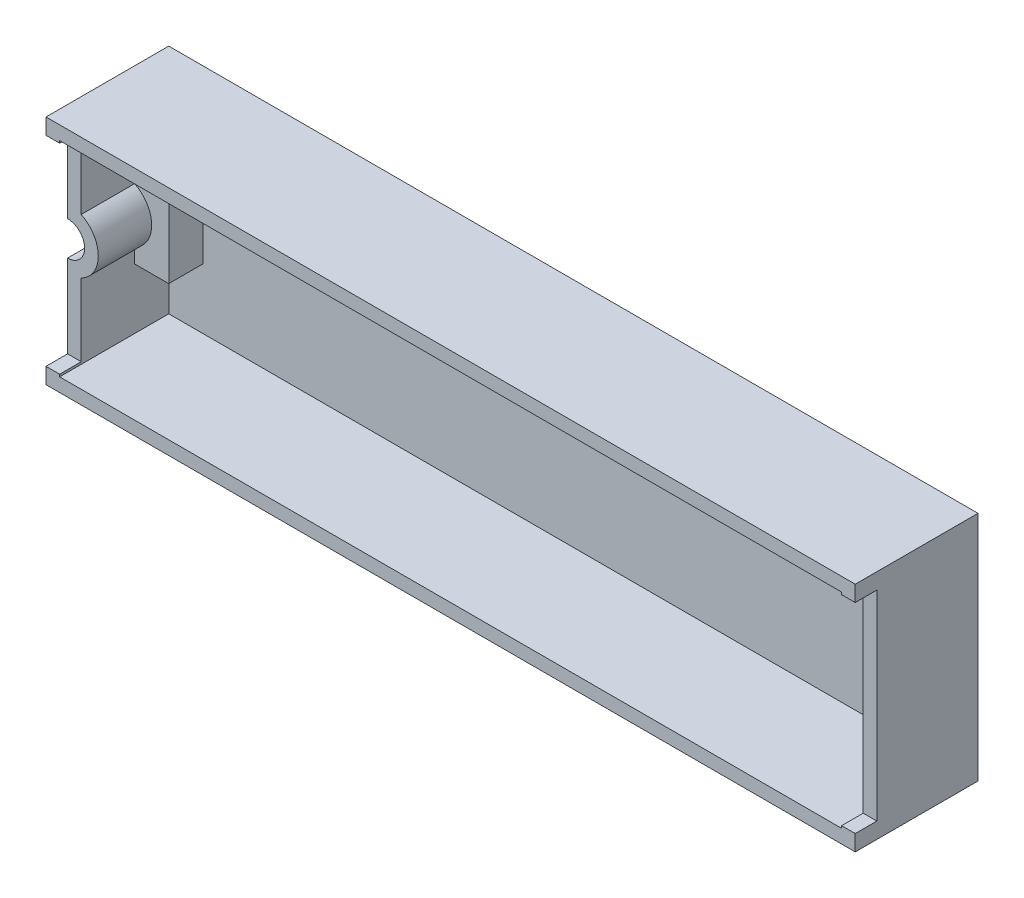
ISO-10303-21;
HEADER;
FILE_DESCRIPTION(('STEP AP214'),'2;1');
FILE_NAME('part.step','',(''),(''),'','','');
FILE_SCHEMA(('AUTOMOTIVE_DESIGN { 1 0 10303 214 1 1 1 1 }'));
ENDSEC;
DATA;
#1=APPLICATION_CONTEXT('core data for automotive mechanical design processes');
#2=APPLICATION_PROTOCOL_DEFINITION('international standard','automotive_design',2000,#1);
#3=PRODUCT_CONTEXT('',#1,'mechanical');
#4=PRODUCT('Part','Part','',(#3));
#5=PRODUCT_RELATED_PRODUCT_CATEGORY('part','',(#4));
#6=PRODUCT_DEFINITION_FORMATION('','',#4);
#7=PRODUCT_DEFINITION_CONTEXT('part definition',#1,'design');
#8=PRODUCT_DEFINITION('design','',#6,#7);
#9=PRODUCT_DEFINITION_SHAPE('','',#8);
#10=(LENGTH_UNIT() NAMED_UNIT(*) SI_UNIT(.MILLI.,.METRE.));
#11=(NAMED_UNIT(*) PLANE_ANGLE_UNIT() SI_UNIT($,.RADIAN.));
#12=(NAMED_UNIT(*) SI_UNIT($,.STERADIAN.) SOLID_ANGLE_UNIT());
#13=UNCERTAINTY_MEASURE_WITH_UNIT(LENGTH_MEASURE(1.E-05),#10,'distance_accuracy_value','');
#14=(GEOMETRIC_REPRESENTATION_CONTEXT(3) GLOBAL_UNCERTAINTY_ASSIGNED_CONTEXT((#13)) GLOBAL_UNIT_ASSIGNED_CONTEXT((#10,
#11,#12)) REPRESENTATION_CONTEXT('',''));
#15=CARTESIAN_POINT('',(0.,0.,0.));
#16=DIRECTION('',(0.,0.,1.));
#17=DIRECTION('',(1.,0.,0.));
#18=AXIS2_PLACEMENT_3D('',#15,#16,#17);
#19=CARTESIAN_POINT('',(-15.7,-1.25,0.));
#20=DIRECTION('',(1.,0.,0.));
#21=DIRECTION('',(0.,0.,-1.));
#22=AXIS2_PLACEMENT_3D('',#19,#20,#21);
#23=PLANE('',#22);
#24=DIRECTION('',(0.,1.,0.));
#25=VECTOR('',#24,1.);
#26=CARTESIAN_POINT('',(-15.7,0.,2.1));
#27=LINE('',#26,#25);
#28=CARTESIAN_POINT('',(-15.7,-1.85,2.1));
#29=VERTEX_POINT('',#28);
#30=CARTESIAN_POINT('',(-15.7,1.85,2.1));
#31=VERTEX_POINT('',#30);
#32=EDGE_CURVE('E291',#29,#31,#27,.T.);
#33=ORIENTED_EDGE('',*,*,#32,.F.);
#34=DIRECTION('',(0.,0.,-1.));
#35=VECTOR('',#34,1.);
#36=CARTESIAN_POINT('',(-15.7,-1.85,0.));
#37=LINE('',#36,#35);
#38=CARTESIAN_POINT('',(-15.7,-1.85,0.6));
#39=VERTEX_POINT('',#38);
#40=EDGE_CURVE('E296',#39,#29,#37,.F.);
#41=ORIENTED_EDGE('',*,*,#40,.F.);
#42=DIRECTION('',(0.,1.,0.));
#43=VECTOR('',#42,1.);
#44=CARTESIAN_POINT('',(-15.7,0.,0.6));
#45=LINE('',#44,#43);
#46=CARTESIAN_POINT('',(-15.7,1.85,0.6));
#47=VERTEX_POINT('',#46);
#48=EDGE_CURVE('E286',#47,#39,#45,.F.);
#49=ORIENTED_EDGE('',*,*,#48,.F.);
#50=DIRECTION('',(0.,0.,1.));
#51=VECTOR('',#50,1.);
#52=CARTESIAN_POINT('',(-15.7,1.85,0.));
#53=LINE('',#52,#51);
#54=EDGE_CURVE('E292',#31,#47,#53,.F.);
#55=ORIENTED_EDGE('',*,*,#54,.F.);
#56=EDGE_LOOP('',(#33,#41,#49,#55));
#57=FACE_BOUND('',#56,.T.);
#58=ADVANCED_FACE('F16',(#57),#23,.T.);
#59=CARTESIAN_POINT('',(-16.3,1.85,0.));
#60=DIRECTION('',(0.,1.,0.));
#61=DIRECTION('',(0.,0.,1.));
#62=AXIS2_PLACEMENT_3D('',#59,#60,#61);
#63=PLANE('',#62);
#64=DIRECTION('',(1.,0.,0.));
#65=VECTOR('',#64,1.);
#66=CARTESIAN_POINT('',(-17.05,1.85,2.1));
#67=LINE('',#66,#65);
#68=CARTESIAN_POINT('',(-17.2,1.85,2.1));
#69=VERTEX_POINT('',#68);
#70=EDGE_CURVE('E214',#31,#69,#67,.F.);
#71=ORIENTED_EDGE('',*,*,#70,.F.);
#72=ORIENTED_EDGE('',*,*,#54,.T.);
#73=DIRECTION('',(1.,0.,0.));
#74=VECTOR('',#73,1.);
#75=CARTESIAN_POINT('',(-0.042575970452277,1.85,0.6));
#76=LINE('',#75,#74);
#77=CARTESIAN_POINT('',(-17.2,1.85,0.6));
#78=VERTEX_POINT('',#77);
#79=EDGE_CURVE('E307',#78,#47,#76,.T.);
#80=ORIENTED_EDGE('',*,*,#79,.F.);
#81=DIRECTION('',(0.,0.,1.));
#82=VECTOR('',#81,1.);
#83=CARTESIAN_POINT('',(-17.2,1.85,0.));
#84=LINE('',#83,#82);
#85=EDGE_CURVE('E218',#78,#69,#84,.T.);
#86=ORIENTED_EDGE('',*,*,#85,.T.);
#87=EDGE_LOOP('',(#71,#72,#80,#86));
#88=FACE_BOUND('',#87,.T.);
#89=ADVANCED_FACE('F643',(#88),#63,.T.);
#90=CARTESIAN_POINT('',(-17.05,0.,2.1));
#91=DIRECTION('',(0.,0.,1.));
#92=DIRECTION('',(1.,0.,0.));
#93=AXIS2_PLACEMENT_3D('',#90,#91,#92);
#94=PLANE('',#93);
#95=ORIENTED_EDGE('',*,*,#70,.T.);
#96=DIRECTION('',(0.,1.,0.));
#97=VECTOR('',#96,1.);
#98=CARTESIAN_POINT('',(-17.2,5.1,2.1));
#99=LINE('',#98,#97);
#100=CARTESIAN_POINT('',(-17.2,1.20933866224478,2.1));
#101=VERTEX_POINT('',#100);
#102=EDGE_CURVE('E210',#69,#101,#99,.F.);
#103=ORIENTED_EDGE('',*,*,#102,.T.);
#104=CARTESIAN_POINT('',(-17.8,0.,2.1));
#105=DIRECTION('',(0.,0.,1.));
#106=DIRECTION('',(1.,0.,0.));
#107=AXIS2_PLACEMENT_3D('',#104,#105,#106);
#108=CIRCLE('',#107,1.35);
#109=CARTESIAN_POINT('',(-17.2,-1.20933866224478,2.1));
#110=VERTEX_POINT('',#109);
#111=EDGE_CURVE('E19',#110,#101,#108,.T.);
#112=ORIENTED_EDGE('',*,*,#111,.F.);
#113=DIRECTION('',(0.,1.,0.));
#114=VECTOR('',#113,1.);
#115=CARTESIAN_POINT('',(-17.2,0.,2.1));
#116=LINE('',#115,#114);
#117=CARTESIAN_POINT('',(-17.2,-1.85,2.1));
#118=VERTEX_POINT('',#117);
#119=EDGE_CURVE('E197',#110,#118,#116,.F.);
#120=ORIENTED_EDGE('',*,*,#119,.T.);
#121=DIRECTION('',(1.,0.,0.));
#122=VECTOR('',#121,1.);
#123=CARTESIAN_POINT('',(-17.8,-1.85,2.1));
#124=LINE('',#123,#122);
#125=EDGE_CURVE('E310',#29,#118,#124,.F.);
#126=ORIENTED_EDGE('',*,*,#125,.F.);
#127=ORIENTED_EDGE('',*,*,#32,.T.);
#128=EDGE_LOOP('',(#95,#103,#112,#120,#126,#127));
#129=FACE_BOUND('',#128,.T.);
#130=ADVANCED_FACE('F212',(#129),#94,.T.);
#131=CARTESIAN_POINT('',(-17.8,-1.85,0.));
#132=DIRECTION('',(0.,-1.,0.));
#133=DIRECTION('',(0.,0.,-1.));
#134=AXIS2_PLACEMENT_3D('',#131,#132,#133);
#135=PLANE('',#134);
#136=ORIENTED_EDGE('',*,*,#125,.T.);
#137=DIRECTION('',(0.,0.,1.));
#138=VECTOR('',#137,1.);
#139=CARTESIAN_POINT('',(-17.2,-1.85,0.));
#140=LINE('',#139,#138);
#141=CARTESIAN_POINT('',(-17.2,-1.85,0.6));
#142=VERTEX_POINT('',#141);
#143=EDGE_CURVE('E225',#118,#142,#140,.F.);
#144=ORIENTED_EDGE('',*,*,#143,.T.);
#145=DIRECTION('',(1.,0.,0.));
#146=VECTOR('',#145,1.);
#147=CARTESIAN_POINT('',(-0.042575970452277,-1.85,0.6));
#148=LINE('',#147,#146);
#149=EDGE_CURVE('E284',#39,#142,#148,.F.);
#150=ORIENTED_EDGE('',*,*,#149,.F.);
#151=ORIENTED_EDGE('',*,*,#40,.T.);
#152=EDGE_LOOP('',(#136,#144,#150,#151));
#153=FACE_BOUND('',#152,.T.);
#154=ADVANCED_FACE('F637',(#153),#135,.T.);
#155=CARTESIAN_POINT('',(-0.042575970452277,0.,0.6));
#156=DIRECTION('',(0.,0.,1.));
#157=DIRECTION('',(1.,0.,0.));
#158=AXIS2_PLACEMENT_3D('',#155,#156,#157);
#159=PLANE('',#158);
#160=DIRECTION('',(1.,0.,0.));
#161=VECTOR('',#160,1.);
#162=CARTESIAN_POINT('',(17.8,4.5,0.6));
#163=LINE('',#162,#161);
#164=CARTESIAN_POINT('',(17.2,4.5,0.6));
#165=VERTEX_POINT('',#164);
#166=CARTESIAN_POINT('',(-17.2,4.5,0.6));
#167=VERTEX_POINT('',#166);
#168=EDGE_CURVE('E232',#165,#167,#163,.F.);
#169=ORIENTED_EDGE('',*,*,#168,.T.);
#170=DIRECTION('',(0.,1.,0.));
#171=VECTOR('',#170,1.);
#172=CARTESIAN_POINT('',(-17.2,5.1,0.6));
#173=LINE('',#172,#171);
#174=EDGE_CURVE('E300',#167,#78,#173,.F.);
#175=ORIENTED_EDGE('',*,*,#174,.T.);
#176=ORIENTED_EDGE('',*,*,#79,.T.);
#177=ORIENTED_EDGE('',*,*,#48,.T.);
#178=ORIENTED_EDGE('',*,*,#149,.T.);
#179=DIRECTION('',(0.,1.,0.));
#180=VECTOR('',#179,1.);
#181=CARTESIAN_POINT('',(-17.2,-0.75,0.6));
#182=LINE('',#181,#180);
#183=CARTESIAN_POINT('',(-17.2,-4.5,0.6));
#184=VERTEX_POINT('',#183);
#185=EDGE_CURVE('E382',#142,#184,#182,.F.);
#186=ORIENTED_EDGE('',*,*,#185,.T.);
#187=DIRECTION('',(1.,0.,0.));
#188=VECTOR('',#187,1.);
#189=CARTESIAN_POINT('',(-17.8,-4.5,0.6));
#190=LINE('',#189,#188);
#191=CARTESIAN_POINT('',(17.2,-4.5,0.6));
#192=VERTEX_POINT('',#191);
#193=EDGE_CURVE('E285',#184,#192,#190,.T.);
#194=ORIENTED_EDGE('',*,*,#193,.T.);
#195=DIRECTION('',(0.,1.,0.));
#196=VECTOR('',#195,1.);
#197=CARTESIAN_POINT('',(17.2,-5.1,0.6));
#198=LINE('',#197,#196);
#199=EDGE_CURVE('E345',#192,#165,#198,.T.);
#200=ORIENTED_EDGE('',*,*,#199,.T.);
#201=EDGE_LOOP('',(#169,#175,#176,#177,#178,#186,#194,#200));
#202=FACE_BOUND('',#201,.T.);
#203=ADVANCED_FACE('F633',(#202),#159,.T.);
#204=CARTESIAN_POINT('',(-17.8,-4.5,0.));
#205=DIRECTION('',(0.,-1.,0.));
#206=DIRECTION('',(0.,0.,-1.));
#207=AXIS2_PLACEMENT_3D('',#204,#205,#206);
#208=PLANE('',#207);
#209=DIRECTION('',(0.,0.,1.));
#210=VECTOR('',#209,1.);
#211=CARTESIAN_POINT('',(-17.2,-4.5,0.));
#212=LINE('',#211,#210);
#213=CARTESIAN_POINT('',(-17.2,-4.5,5.4));
#214=VERTEX_POINT('',#213);
#215=EDGE_CURVE('E379',#184,#214,#212,.T.);
#216=ORIENTED_EDGE('',*,*,#215,.T.);
#217=DIRECTION('',(1.,0.,0.));
#218=VECTOR('',#217,1.);
#219=CARTESIAN_POINT('',(-0.042575970452277,-4.5,5.4));
#220=LINE('',#219,#218);
#221=CARTESIAN_POINT('',(17.2,-4.5,5.4));
#222=VERTEX_POINT('',#221);
#223=EDGE_CURVE('E245',#222,#214,#220,.F.);
#224=ORIENTED_EDGE('',*,*,#223,.F.);
#225=DIRECTION('',(0.,0.,-1.));
#226=VECTOR('',#225,1.);
#227=CARTESIAN_POINT('',(17.2,-4.5,0.));
#228=LINE('',#227,#226);
#229=EDGE_CURVE('E347',#222,#192,#228,.T.);
#230=ORIENTED_EDGE('',*,*,#229,.T.);
#231=ORIENTED_EDGE('',*,*,#193,.F.);
#232=EDGE_LOOP('',(#216,#224,#230,#231));
#233=FACE_BOUND('',#232,.T.);
#234=ADVANCED_FACE('F629',(#233),#208,.F.);
#235=CARTESIAN_POINT('',(17.2,-5.1,0.));
#236=DIRECTION('',(1.,0.,0.));
#237=DIRECTION('',(0.,0.,-1.));
#238=AXIS2_PLACEMENT_3D('',#235,#236,#237);
#239=PLANE('',#238);
#240=DIRECTION('',(0.,1.,0.));
#241=VECTOR('',#240,1.);
#242=CARTESIAN_POINT('',(17.2,-4.4,4.45));
#243=LINE('',#242,#241);
#244=CARTESIAN_POINT('',(17.2,-4.4,4.45));
#245=VERTEX_POINT('',#244);
#246=CARTESIAN_POINT('',(17.2,4.4,4.45));
#247=VERTEX_POINT('',#246);
#248=EDGE_CURVE('E362',#245,#247,#243,.T.);
#249=ORIENTED_EDGE('',*,*,#248,.T.);
#250=DIRECTION('',(0.,0.,1.));
#251=VECTOR('',#250,1.);
#252=CARTESIAN_POINT('',(17.2,4.4,4.45));
#253=LINE('',#252,#251);
#254=CARTESIAN_POINT('',(17.2,4.4,5.4));
#255=VERTEX_POINT('',#254);
#256=EDGE_CURVE('E353',#247,#255,#253,.T.);
#257=ORIENTED_EDGE('',*,*,#256,.T.);
#258=DIRECTION('',(0.,1.,0.));
#259=VECTOR('',#258,1.);
#260=CARTESIAN_POINT('',(17.2,-5.1,5.4));
#261=LINE('',#260,#259);
#262=CARTESIAN_POINT('',(17.2,4.5,5.4));
#263=VERTEX_POINT('',#262);
#264=EDGE_CURVE('E342',#263,#255,#261,.F.);
#265=ORIENTED_EDGE('',*,*,#264,.F.);
#266=DIRECTION('',(0.,0.,1.));
#267=VECTOR('',#266,1.);
#268=CARTESIAN_POINT('',(17.2,4.5,0.));
#269=LINE('',#268,#267);
#270=EDGE_CURVE('E318',#263,#165,#269,.F.);
#271=ORIENTED_EDGE('',*,*,#270,.T.);
#272=ORIENTED_EDGE('',*,*,#199,.F.);
#273=ORIENTED_EDGE('',*,*,#229,.F.);
#274=DIRECTION('',(0.,1.,0.));
#275=VECTOR('',#274,1.);
#276=CARTESIAN_POINT('',(17.2,0.,5.4));
#277=LINE('',#276,#275);
#278=CARTESIAN_POINT('',(17.2,-4.4,5.4));
#279=VERTEX_POINT('',#278);
#280=EDGE_CURVE('E238',#279,#222,#277,.F.);
#281=ORIENTED_EDGE('',*,*,#280,.F.);
#282=DIRECTION('',(0.,0.,-1.));
#283=VECTOR('',#282,1.);
#284=CARTESIAN_POINT('',(17.2,-4.4,5.4));
#285=LINE('',#284,#283);
#286=EDGE_CURVE('E357',#279,#245,#285,.T.);
#287=ORIENTED_EDGE('',*,*,#286,.T.);
#288=EDGE_LOOP('',(#249,#257,#265,#271,#272,#273,#281,#287));
#289=FACE_BOUND('',#288,.T.);
#290=ADVANCED_FACE('F625',(#289),#239,.F.);
#291=CARTESIAN_POINT('',(17.8,4.5,0.));
#292=DIRECTION('',(0.,1.,0.));
#293=DIRECTION('',(0.,0.,1.));
#294=AXIS2_PLACEMENT_3D('',#291,#292,#293);
#295=PLANE('',#294);
#296=ORIENTED_EDGE('',*,*,#270,.F.);
#297=DIRECTION('',(1.,0.,0.));
#298=VECTOR('',#297,1.);
#299=CARTESIAN_POINT('',(-0.042575970452277,4.5,5.4));
#300=LINE('',#299,#298);
#301=CARTESIAN_POINT('',(-17.2,4.5,5.4));
#302=VERTEX_POINT('',#301);
#303=EDGE_CURVE('E324',#302,#263,#300,.T.);
#304=ORIENTED_EDGE('',*,*,#303,.F.);
#305=DIRECTION('',(0.,0.,1.));
#306=VECTOR('',#305,1.);
#307=CARTESIAN_POINT('',(-17.2,4.5,0.));
#308=LINE('',#307,#306);
#309=EDGE_CURVE('E231',#302,#167,#308,.F.);
#310=ORIENTED_EDGE('',*,*,#309,.T.);
#311=ORIENTED_EDGE('',*,*,#168,.F.);
#312=EDGE_LOOP('',(#296,#304,#310,#311));
#313=FACE_BOUND('',#312,.T.);
#314=ADVANCED_FACE('F622',(#313),#295,.F.);
#315=CARTESIAN_POINT('',(-17.2,5.1,0.));
#316=DIRECTION('',(-1.,0.,0.));
#317=DIRECTION('',(0.,0.,1.));
#318=AXIS2_PLACEMENT_3D('',#315,#316,#317);
#319=PLANE('',#318);
#320=DIRECTION('',(0.,0.,1.));
#321=VECTOR('',#320,1.);
#322=CARTESIAN_POINT('',(-17.2,1.20933866224478,0.));
#323=LINE('',#322,#321);
#324=CARTESIAN_POINT('',(-17.2,1.20933866224478,4.45));
#325=VERTEX_POINT('',#324);
#326=EDGE_CURVE('E206',#101,#325,#323,.T.);
#327=ORIENTED_EDGE('',*,*,#326,.F.);
#328=ORIENTED_EDGE('',*,*,#102,.F.);
#329=ORIENTED_EDGE('',*,*,#85,.F.);
#330=ORIENTED_EDGE('',*,*,#174,.F.);
#331=ORIENTED_EDGE('',*,*,#309,.F.);
#332=DIRECTION('',(0.,1.,0.));
#333=VECTOR('',#332,1.);
#334=CARTESIAN_POINT('',(-17.2,0.,5.4));
#335=LINE('',#334,#333);
#336=CARTESIAN_POINT('',(-17.2,4.4,5.4));
#337=VERTEX_POINT('',#336);
#338=EDGE_CURVE('E321',#337,#302,#335,.T.);
#339=ORIENTED_EDGE('',*,*,#338,.F.);
#340=DIRECTION('',(0.,0.,1.));
#341=VECTOR('',#340,1.);
#342=CARTESIAN_POINT('',(-17.2,4.4,0.));
#343=LINE('',#342,#341);
#344=CARTESIAN_POINT('',(-17.2,4.4,4.45));
#345=VERTEX_POINT('',#344);
#346=EDGE_CURVE('E229',#345,#337,#343,.T.);
#347=ORIENTED_EDGE('',*,*,#346,.F.);
#348=DIRECTION('',(0.,1.,0.));
#349=VECTOR('',#348,1.);
#350=CARTESIAN_POINT('',(-17.2,-4.4,4.45));
#351=LINE('',#350,#349);
#352=EDGE_CURVE('E223',#345,#325,#351,.F.);
#353=ORIENTED_EDGE('',*,*,#352,.T.);
#354=EDGE_LOOP('',(#327,#328,#329,#330,#331,#339,#347,#353));
#355=FACE_BOUND('',#354,.T.);
#356=ADVANCED_FACE('F221',(#355),#319,.F.);
#357=CARTESIAN_POINT('',(-17.8,0.,0.));
#358=DIRECTION('',(0.,0.,1.));
#359=DIRECTION('',(1.,0.,0.));
#360=AXIS2_PLACEMENT_3D('',#357,#358,#359);
#361=CYLINDRICAL_SURFACE('',#360,1.35);
#362=ORIENTED_EDGE('',*,*,#111,.T.);
#363=ORIENTED_EDGE('',*,*,#326,.T.);
#364=CARTESIAN_POINT('',(-17.8,0.,4.45));
#365=DIRECTION('',(0.,0.,1.));
#366=DIRECTION('',(1.,0.,0.));
#367=AXIS2_PLACEMENT_3D('',#364,#365,#366);
#368=CIRCLE('',#367,1.35);
#369=CARTESIAN_POINT('',(-17.2,-1.20933866224478,4.45));
#370=VERTEX_POINT('',#369);
#371=EDGE_CURVE('E412',#325,#370,#368,.F.);
#372=ORIENTED_EDGE('',*,*,#371,.T.);
#373=DIRECTION('',(0.,0.,1.));
#374=VECTOR('',#373,1.);
#375=CARTESIAN_POINT('',(-17.2,-1.20933866224478,0.));
#376=LINE('',#375,#374);
#377=EDGE_CURVE('E208',#370,#110,#376,.F.);
#378=ORIENTED_EDGE('',*,*,#377,.T.);
#379=EDGE_LOOP('',(#362,#363,#372,#378));
#380=FACE_BOUND('',#379,.T.);
#381=ADVANCED_FACE('F203',(#380),#361,.T.);
#382=CARTESIAN_POINT('',(-17.2,-0.75,0.));
#383=DIRECTION('',(-1.,0.,0.));
#384=DIRECTION('',(0.,0.,1.));
#385=AXIS2_PLACEMENT_3D('',#382,#383,#384);
#386=PLANE('',#385);
#387=DIRECTION('',(0.,0.,-1.));
#388=VECTOR('',#387,1.);
#389=CARTESIAN_POINT('',(-17.2,-4.4,5.4));
#390=LINE('',#389,#388);
#391=CARTESIAN_POINT('',(-17.2,-4.4,4.45));
#392=VERTEX_POINT('',#391);
#393=CARTESIAN_POINT('',(-17.2,-4.4,5.4));
#394=VERTEX_POINT('',#393);
#395=EDGE_CURVE('E235',#392,#394,#390,.F.);
#396=ORIENTED_EDGE('',*,*,#395,.T.);
#397=DIRECTION('',(0.,1.,0.));
#398=VECTOR('',#397,1.);
#399=CARTESIAN_POINT('',(-17.2,0.,5.4));
#400=LINE('',#399,#398);
#401=EDGE_CURVE('E242',#214,#394,#400,.T.);
#402=ORIENTED_EDGE('',*,*,#401,.F.);
#403=ORIENTED_EDGE('',*,*,#215,.F.);
#404=ORIENTED_EDGE('',*,*,#185,.F.);
#405=ORIENTED_EDGE('',*,*,#143,.F.);
#406=ORIENTED_EDGE('',*,*,#119,.F.);
#407=ORIENTED_EDGE('',*,*,#377,.F.);
#408=DIRECTION('',(0.,1.,0.));
#409=VECTOR('',#408,1.);
#410=CARTESIAN_POINT('',(-17.2,-4.4,4.45));
#411=LINE('',#410,#409);
#412=EDGE_CURVE('E413',#370,#392,#411,.F.);
#413=ORIENTED_EDGE('',*,*,#412,.T.);
#414=EDGE_LOOP('',(#396,#402,#403,#404,#405,#406,#407,#413));
#415=FACE_BOUND('',#414,.T.);
#416=ADVANCED_FACE('F615',(#415),#386,.F.);
#417=CARTESIAN_POINT('',(-17.05,0.,1.5));
#418=DIRECTION('',(0.,0.,1.));
#419=DIRECTION('',(1.,0.,0.));
#420=AXIS2_PLACEMENT_3D('',#417,#418,#419);
#421=PLANE('',#420);
#422=DIRECTION('',(0.,1.,0.));
#423=VECTOR('',#422,1.);
#424=CARTESIAN_POINT('',(-17.8,0.,1.5));
#425=LINE('',#424,#423);
#426=CARTESIAN_POINT('',(-17.8,1.25,1.5));
#427=VERTEX_POINT('',#426);
#428=CARTESIAN_POINT('',(-17.8,0.75,1.5));
#429=VERTEX_POINT('',#428);
#430=EDGE_CURVE('E239',#427,#429,#425,.F.);
#431=ORIENTED_EDGE('',*,*,#430,.F.);
#432=DIRECTION('',(1.,0.,0.));
#433=VECTOR('',#432,1.);
#434=CARTESIAN_POINT('',(-17.05,1.25,1.5));
#435=LINE('',#434,#433);
#436=CARTESIAN_POINT('',(-16.3,1.25,1.5));
#437=VERTEX_POINT('',#436);
#438=EDGE_CURVE('E257',#437,#427,#435,.F.);
#439=ORIENTED_EDGE('',*,*,#438,.F.);
#440=DIRECTION('',(0.,1.,0.));
#441=VECTOR('',#440,1.);
#442=CARTESIAN_POINT('',(-16.3,-1.25,1.5));
#443=LINE('',#442,#441);
#444=CARTESIAN_POINT('',(-16.3,-1.25,1.5));
#445=VERTEX_POINT('',#444);
#446=EDGE_CURVE('E262',#437,#445,#443,.F.);
#447=ORIENTED_EDGE('',*,*,#446,.T.);
#448=DIRECTION('',(1.,0.,0.));
#449=VECTOR('',#448,1.);
#450=CARTESIAN_POINT('',(-17.05,-1.25,1.5));
#451=LINE('',#450,#449);
#452=CARTESIAN_POINT('',(-17.8,-1.25,1.5));
#453=VERTEX_POINT('',#452);
#454=EDGE_CURVE('E259',#453,#445,#451,.T.);
#455=ORIENTED_EDGE('',*,*,#454,.F.);
#456=DIRECTION('',(0.,1.,0.));
#457=VECTOR('',#456,1.);
#458=CARTESIAN_POINT('',(-17.8,0.,1.5));
#459=LINE('',#458,#457);
#460=CARTESIAN_POINT('',(-17.8,-0.75,1.5));
#461=VERTEX_POINT('',#460);
#462=EDGE_CURVE('E275',#461,#453,#459,.F.);
#463=ORIENTED_EDGE('',*,*,#462,.F.);
#464=CARTESIAN_POINT('',(-17.8,0.,1.5));
#465=DIRECTION('',(0.,0.,1.));
#466=DIRECTION('',(1.,0.,0.));
#467=AXIS2_PLACEMENT_3D('',#464,#465,#466);
#468=CIRCLE('',#467,0.75);
#469=EDGE_CURVE('E336',#461,#429,#468,.T.);
#470=ORIENTED_EDGE('',*,*,#469,.T.);
#471=EDGE_LOOP('',(#431,#439,#447,#455,#463,#470));
#472=FACE_BOUND('',#471,.T.);
#473=ADVANCED_FACE('F481',(#472),#421,.F.);
#474=CARTESIAN_POINT('',(-17.8,-4.4,5.4));
#475=DIRECTION('',(0.,-1.,0.));
#476=DIRECTION('',(0.,0.,-1.));
#477=AXIS2_PLACEMENT_3D('',#474,#475,#476);
#478=PLANE('',#477);
#479=DIRECTION('',(-1.,0.,0.));
#480=VECTOR('',#479,1.);
#481=CARTESIAN_POINT('',(-17.8,-4.4,4.45));
#482=LINE('',#481,#480);
#483=CARTESIAN_POINT('',(-17.8,-4.4,4.45));
#484=VERTEX_POINT('',#483);
#485=EDGE_CURVE('E330',#392,#484,#482,.T.);
#486=ORIENTED_EDGE('',*,*,#485,.T.);
#487=DIRECTION('',(0.,0.,1.));
#488=VECTOR('',#487,1.);
#489=CARTESIAN_POINT('',(-17.8,-4.4,0.));
#490=LINE('',#489,#488);
#491=CARTESIAN_POINT('',(-17.8,-4.4,5.4));
#492=VERTEX_POINT('',#491);
#493=EDGE_CURVE('E461',#492,#484,#490,.F.);
#494=ORIENTED_EDGE('',*,*,#493,.F.);
#495=DIRECTION('',(1.,0.,0.));
#496=VECTOR('',#495,1.);
#497=CARTESIAN_POINT('',(-0.042575970452277,-4.4,5.4));
#498=LINE('',#497,#496);
#499=EDGE_CURVE('E244',#394,#492,#498,.F.);
#500=ORIENTED_EDGE('',*,*,#499,.F.);
#501=ORIENTED_EDGE('',*,*,#395,.F.);
#502=EDGE_LOOP('',(#486,#494,#500,#501));
#503=FACE_BOUND('',#502,.T.);
#504=ADVANCED_FACE('F608',(#503),#478,.F.);
#505=CARTESIAN_POINT('',(-0.042575970452277,0.,5.4));
#506=DIRECTION('',(0.,0.,1.));
#507=DIRECTION('',(1.,0.,0.));
#508=AXIS2_PLACEMENT_3D('',#505,#506,#507);
#509=PLANE('',#508);
#510=DIRECTION('',(1.,0.,0.));
#511=VECTOR('',#510,1.);
#512=CARTESIAN_POINT('',(-17.8,-5.1,5.4));
#513=LINE('',#512,#511);
#514=CARTESIAN_POINT('',(17.8,-5.1,5.4));
#515=VERTEX_POINT('',#514);
#516=CARTESIAN_POINT('',(-17.8,-5.1,5.4));
#517=VERTEX_POINT('',#516);
#518=EDGE_CURVE('E464',#515,#517,#513,.F.);
#519=ORIENTED_EDGE('',*,*,#518,.F.);
#520=DIRECTION('',(0.,1.,0.));
#521=VECTOR('',#520,1.);
#522=CARTESIAN_POINT('',(17.8,0.,5.4));
#523=LINE('',#522,#521);
#524=CARTESIAN_POINT('',(17.8,-4.4,5.4));
#525=VERTEX_POINT('',#524);
#526=EDGE_CURVE('E249',#515,#525,#523,.T.);
#527=ORIENTED_EDGE('',*,*,#526,.T.);
#528=DIRECTION('',(1.,0.,0.));
#529=VECTOR('',#528,1.);
#530=CARTESIAN_POINT('',(-17.8,-4.4,5.4));
#531=LINE('',#530,#529);
#532=EDGE_CURVE('E449',#525,#279,#531,.F.);
#533=ORIENTED_EDGE('',*,*,#532,.T.);
#534=ORIENTED_EDGE('',*,*,#280,.T.);
#535=ORIENTED_EDGE('',*,*,#223,.T.);
#536=ORIENTED_EDGE('',*,*,#401,.T.);
#537=ORIENTED_EDGE('',*,*,#499,.T.);
#538=DIRECTION('',(0.,1.,0.));
#539=VECTOR('',#538,1.);
#540=CARTESIAN_POINT('',(-17.8,-0.75,5.4));
#541=LINE('',#540,#539);
#542=EDGE_CURVE('E280',#517,#492,#541,.T.);
#543=ORIENTED_EDGE('',*,*,#542,.F.);
#544=EDGE_LOOP('',(#519,#527,#533,#534,#535,#536,#537,#543));
#545=FACE_BOUND('',#544,.T.);
#546=ADVANCED_FACE('F604',(#545),#509,.T.);
#547=CARTESIAN_POINT('',(-17.8,-4.4,5.4));
#548=DIRECTION('',(0.,-1.,0.));
#549=DIRECTION('',(0.,0.,-1.));
#550=AXIS2_PLACEMENT_3D('',#547,#548,#549);
#551=PLANE('',#550);
#552=ORIENTED_EDGE('',*,*,#532,.F.);
#553=DIRECTION('',(0.,0.,-1.));
#554=VECTOR('',#553,1.);
#555=CARTESIAN_POINT('',(17.8,-4.4,0.));
#556=LINE('',#555,#554);
#557=CARTESIAN_POINT('',(17.8,-4.4,4.45));
#558=VERTEX_POINT('',#557);
#559=EDGE_CURVE('E526',#558,#525,#556,.F.);
#560=ORIENTED_EDGE('',*,*,#559,.F.);
#561=DIRECTION('',(-1.,0.,0.));
#562=VECTOR('',#561,1.);
#563=CARTESIAN_POINT('',(-17.8,-4.4,4.45));
#564=LINE('',#563,#562);
#565=EDGE_CURVE('E443',#558,#245,#564,.T.);
#566=ORIENTED_EDGE('',*,*,#565,.T.);
#567=ORIENTED_EDGE('',*,*,#286,.F.);
#568=EDGE_LOOP('',(#552,#560,#566,#567));
#569=FACE_BOUND('',#568,.T.);
#570=ADVANCED_FACE('F600',(#569),#551,.F.);
#571=CARTESIAN_POINT('',(-17.8,4.4,4.45));
#572=DIRECTION('',(0.,1.,0.));
#573=DIRECTION('',(0.,0.,1.));
#574=AXIS2_PLACEMENT_3D('',#571,#572,#573);
#575=PLANE('',#574);
#576=DIRECTION('',(-1.,0.,0.));
#577=VECTOR('',#576,1.);
#578=CARTESIAN_POINT('',(-17.8,4.4,4.45));
#579=LINE('',#578,#577);
#580=CARTESIAN_POINT('',(17.8,4.4,4.45));
#581=VERTEX_POINT('',#580);
#582=EDGE_CURVE('E356',#247,#581,#579,.F.);
#583=ORIENTED_EDGE('',*,*,#582,.T.);
#584=DIRECTION('',(0.,0.,-1.));
#585=VECTOR('',#584,1.);
#586=CARTESIAN_POINT('',(17.8,4.4,0.));
#587=LINE('',#586,#585);
#588=CARTESIAN_POINT('',(17.8,4.4,5.4));
#589=VERTEX_POINT('',#588);
#590=EDGE_CURVE('E521',#589,#581,#587,.T.);
#591=ORIENTED_EDGE('',*,*,#590,.F.);
#592=DIRECTION('',(1.,0.,0.));
#593=VECTOR('',#592,1.);
#594=CARTESIAN_POINT('',(-0.042575970452277,4.4,5.4));
#595=LINE('',#594,#593);
#596=EDGE_CURVE('E360',#255,#589,#595,.T.);
#597=ORIENTED_EDGE('',*,*,#596,.F.);
#598=ORIENTED_EDGE('',*,*,#256,.F.);
#599=EDGE_LOOP('',(#583,#591,#597,#598));
#600=FACE_BOUND('',#599,.T.);
#601=ADVANCED_FACE('F596',(#600),#575,.F.);
#602=CARTESIAN_POINT('',(-17.8,-4.4,4.45));
#603=DIRECTION('',(0.,0.,-1.));
#604=DIRECTION('',(-1.,0.,0.));
#605=AXIS2_PLACEMENT_3D('',#602,#603,#604);
#606=PLANE('',#605);
#607=ORIENTED_EDGE('',*,*,#565,.F.);
#608=DIRECTION('',(0.,1.,0.));
#609=VECTOR('',#608,1.);
#610=CARTESIAN_POINT('',(17.8,-5.1,4.45));
#611=LINE('',#610,#609);
#612=EDGE_CURVE('E508',#581,#558,#611,.F.);
#613=ORIENTED_EDGE('',*,*,#612,.F.);
#614=ORIENTED_EDGE('',*,*,#582,.F.);
#615=ORIENTED_EDGE('',*,*,#248,.F.);
#616=EDGE_LOOP('',(#607,#613,#614,#615));
#617=FACE_BOUND('',#616,.T.);
#618=ADVANCED_FACE('F593',(#617),#606,.F.);
#619=CARTESIAN_POINT('',(-0.042575970452277,0.,5.4));
#620=DIRECTION('',(0.,0.,1.));
#621=DIRECTION('',(1.,0.,0.));
#622=AXIS2_PLACEMENT_3D('',#619,#620,#621);
#623=PLANE('',#622);
#624=ORIENTED_EDGE('',*,*,#303,.T.);
#625=ORIENTED_EDGE('',*,*,#264,.T.);
#626=ORIENTED_EDGE('',*,*,#596,.T.);
#627=DIRECTION('',(0.,1.,0.));
#628=VECTOR('',#627,1.);
#629=CARTESIAN_POINT('',(17.8,-5.1,5.4));
#630=LINE('',#629,#628);
#631=CARTESIAN_POINT('',(17.8,5.1,5.4));
#632=VERTEX_POINT('',#631);
#633=EDGE_CURVE('E505',#632,#589,#630,.F.);
#634=ORIENTED_EDGE('',*,*,#633,.F.);
#635=DIRECTION('',(1.,0.,0.));
#636=VECTOR('',#635,1.);
#637=CARTESIAN_POINT('',(17.8,5.1,5.4));
#638=LINE('',#637,#636);
#639=CARTESIAN_POINT('',(-17.8,5.1,5.4));
#640=VERTEX_POINT('',#639);
#641=EDGE_CURVE('E502',#640,#632,#638,.T.);
#642=ORIENTED_EDGE('',*,*,#641,.F.);
#643=DIRECTION('',(0.,1.,0.));
#644=VECTOR('',#643,1.);
#645=CARTESIAN_POINT('',(-17.8,0.,5.4));
#646=LINE('',#645,#644);
#647=CARTESIAN_POINT('',(-17.8,4.4,5.4));
#648=VERTEX_POINT('',#647);
#649=EDGE_CURVE('E325',#640,#648,#646,.F.);
#650=ORIENTED_EDGE('',*,*,#649,.T.);
#651=DIRECTION('',(1.,0.,0.));
#652=VECTOR('',#651,1.);
#653=CARTESIAN_POINT('',(-17.8,4.4,5.4));
#654=LINE('',#653,#652);
#655=EDGE_CURVE('E333',#648,#337,#654,.T.);
#656=ORIENTED_EDGE('',*,*,#655,.T.);
#657=ORIENTED_EDGE('',*,*,#338,.T.);
#658=EDGE_LOOP('',(#624,#625,#626,#634,#642,#650,#656,#657));
#659=FACE_BOUND('',#658,.T.);
#660=ADVANCED_FACE('F503',(#659),#623,.T.);
#661=CARTESIAN_POINT('',(-17.8,-4.4,4.45));
#662=DIRECTION('',(0.,0.,-1.));
#663=DIRECTION('',(-1.,0.,0.));
#664=AXIS2_PLACEMENT_3D('',#661,#662,#663);
#665=PLANE('',#664);
#666=ORIENTED_EDGE('',*,*,#371,.F.);
#667=ORIENTED_EDGE('',*,*,#352,.F.);
#668=DIRECTION('',(1.,0.,0.));
#669=VECTOR('',#668,1.);
#670=CARTESIAN_POINT('',(-17.8,4.4,4.45));
#671=LINE('',#670,#669);
#672=CARTESIAN_POINT('',(-17.8,4.4,4.45));
#673=VERTEX_POINT('',#672);
#674=EDGE_CURVE('E337',#345,#673,#671,.F.);
#675=ORIENTED_EDGE('',*,*,#674,.T.);
#676=DIRECTION('',(0.,1.,0.));
#677=VECTOR('',#676,1.);
#678=CARTESIAN_POINT('',(-17.8,5.1,4.45));
#679=LINE('',#678,#677);
#680=CARTESIAN_POINT('',(-17.8,0.75,4.45));
#681=VERTEX_POINT('',#680);
#682=EDGE_CURVE('E426',#681,#673,#679,.T.);
#683=ORIENTED_EDGE('',*,*,#682,.F.);
#684=CARTESIAN_POINT('',(-17.8,0.,4.45));
#685=DIRECTION('',(0.,0.,1.));
#686=DIRECTION('',(1.,0.,0.));
#687=AXIS2_PLACEMENT_3D('',#684,#685,#686);
#688=CIRCLE('',#687,0.75);
#689=CARTESIAN_POINT('',(-17.8,-0.75,4.45));
#690=VERTEX_POINT('',#689);
#691=EDGE_CURVE('E266',#681,#690,#688,.F.);
#692=ORIENTED_EDGE('',*,*,#691,.T.);
#693=DIRECTION('',(0.,1.,0.));
#694=VECTOR('',#693,1.);
#695=CARTESIAN_POINT('',(-17.8,-0.75,4.45));
#696=LINE('',#695,#694);
#697=EDGE_CURVE('E453',#484,#690,#696,.T.);
#698=ORIENTED_EDGE('',*,*,#697,.F.);
#699=ORIENTED_EDGE('',*,*,#485,.F.);
#700=ORIENTED_EDGE('',*,*,#412,.F.);
#701=EDGE_LOOP('',(#666,#667,#675,#683,#692,#698,#699,#700));
#702=FACE_BOUND('',#701,.T.);
#703=ADVANCED_FACE('F489',(#702),#665,.F.);
#704=CARTESIAN_POINT('',(-17.8,4.4,4.45));
#705=DIRECTION('',(0.,1.,0.));
#706=DIRECTION('',(0.,0.,1.));
#707=AXIS2_PLACEMENT_3D('',#704,#705,#706);
#708=PLANE('',#707);
#709=ORIENTED_EDGE('',*,*,#655,.F.);
#710=DIRECTION('',(0.,0.,1.));
#711=VECTOR('',#710,1.);
#712=CARTESIAN_POINT('',(-17.8,4.4,0.));
#713=LINE('',#712,#711);
#714=EDGE_CURVE('E428',#673,#648,#713,.T.);
#715=ORIENTED_EDGE('',*,*,#714,.F.);
#716=ORIENTED_EDGE('',*,*,#674,.F.);
#717=ORIENTED_EDGE('',*,*,#346,.T.);
#718=EDGE_LOOP('',(#709,#715,#716,#717));
#719=FACE_BOUND('',#718,.T.);
#720=ADVANCED_FACE('F495',(#719),#708,.F.);
#721=CARTESIAN_POINT('',(-17.8,0.,0.));
#722=DIRECTION('',(0.,0.,1.));
#723=DIRECTION('',(1.,0.,0.));
#724=AXIS2_PLACEMENT_3D('',#721,#722,#723);
#725=CYLINDRICAL_SURFACE('',#724,0.75);
#726=DIRECTION('',(0.,0.,1.));
#727=VECTOR('',#726,1.);
#728=CARTESIAN_POINT('',(-17.8,0.75,0.));
#729=LINE('',#728,#727);
#730=EDGE_CURVE('E254',#429,#681,#729,.T.);
#731=ORIENTED_EDGE('',*,*,#730,.F.);
#732=ORIENTED_EDGE('',*,*,#469,.F.);
#733=DIRECTION('',(0.,0.,1.));
#734=VECTOR('',#733,1.);
#735=CARTESIAN_POINT('',(-17.8,-0.75,0.));
#736=LINE('',#735,#734);
#737=EDGE_CURVE('E281',#690,#461,#736,.F.);
#738=ORIENTED_EDGE('',*,*,#737,.F.);
#739=ORIENTED_EDGE('',*,*,#691,.F.);
#740=EDGE_LOOP('',(#731,#732,#738,#739));
#741=FACE_BOUND('',#740,.T.);
#742=ADVANCED_FACE('F484',(#741),#725,.F.);
#743=CARTESIAN_POINT('',(-16.3,-1.25,0.));
#744=DIRECTION('',(1.,0.,0.));
#745=DIRECTION('',(0.,0.,-1.));
#746=AXIS2_PLACEMENT_3D('',#743,#744,#745);
#747=PLANE('',#746);
#748=DIRECTION('',(0.,0.,-1.));
#749=VECTOR('',#748,1.);
#750=CARTESIAN_POINT('',(-16.3,-1.25,0.));
#751=LINE('',#750,#749);
#752=CARTESIAN_POINT('',(-16.3,-1.25,0.));
#753=VERTEX_POINT('',#752);
#754=EDGE_CURVE('E265',#753,#445,#751,.F.);
#755=ORIENTED_EDGE('',*,*,#754,.T.);
#756=ORIENTED_EDGE('',*,*,#446,.F.);
#757=DIRECTION('',(0.,0.,1.));
#758=VECTOR('',#757,1.);
#759=CARTESIAN_POINT('',(-16.3,1.25,0.));
#760=LINE('',#759,#758);
#761=CARTESIAN_POINT('',(-16.3,1.25,0.));
#762=VERTEX_POINT('',#761);
#763=EDGE_CURVE('E253',#437,#762,#760,.F.);
#764=ORIENTED_EDGE('',*,*,#763,.T.);
#765=DIRECTION('',(0.,1.,0.));
#766=VECTOR('',#765,1.);
#767=CARTESIAN_POINT('',(-16.3,0.,0.));
#768=LINE('',#767,#766);
#769=EDGE_CURVE('E271',#762,#753,#768,.F.);
#770=ORIENTED_EDGE('',*,*,#769,.T.);
#771=EDGE_LOOP('',(#755,#756,#764,#770));
#772=FACE_BOUND('',#771,.T.);
#773=ADVANCED_FACE('F537',(#772),#747,.F.);
#774=CARTESIAN_POINT('',(-17.8,-1.25,0.));
#775=DIRECTION('',(0.,-1.,0.));
#776=DIRECTION('',(0.,0.,-1.));
#777=AXIS2_PLACEMENT_3D('',#774,#775,#776);
#778=PLANE('',#777);
#779=DIRECTION('',(0.,0.,1.));
#780=VECTOR('',#779,1.);
#781=CARTESIAN_POINT('',(-17.8,-1.25,0.));
#782=LINE('',#781,#780);
#783=CARTESIAN_POINT('',(-17.8,-1.25,0.));
#784=VERTEX_POINT('',#783);
#785=EDGE_CURVE('E278',#453,#784,#782,.F.);
#786=ORIENTED_EDGE('',*,*,#785,.F.);
#787=ORIENTED_EDGE('',*,*,#454,.T.);
#788=ORIENTED_EDGE('',*,*,#754,.F.);
#789=DIRECTION('',(1.,0.,0.));
#790=VECTOR('',#789,1.);
#791=CARTESIAN_POINT('',(-0.042575970452277,-1.25,0.));
#792=LINE('',#791,#790);
#793=EDGE_CURVE('E543',#753,#784,#792,.F.);
#794=ORIENTED_EDGE('',*,*,#793,.T.);
#795=EDGE_LOOP('',(#786,#787,#788,#794));
#796=FACE_BOUND('',#795,.T.);
#797=ADVANCED_FACE('F542',(#796),#778,.F.);
#798=CARTESIAN_POINT('',(-17.8,-0.75,0.));
#799=DIRECTION('',(-1.,0.,0.));
#800=DIRECTION('',(0.,0.,1.));
#801=AXIS2_PLACEMENT_3D('',#798,#799,#800);
#802=PLANE('',#801);
#803=ORIENTED_EDGE('',*,*,#542,.T.);
#804=ORIENTED_EDGE('',*,*,#493,.T.);
#805=ORIENTED_EDGE('',*,*,#697,.T.);
#806=ORIENTED_EDGE('',*,*,#737,.T.);
#807=ORIENTED_EDGE('',*,*,#462,.T.);
#808=ORIENTED_EDGE('',*,*,#785,.T.);
#809=DIRECTION('',(0.,1.,0.));
#810=VECTOR('',#809,1.);
#811=CARTESIAN_POINT('',(-17.8,0.,0.));
#812=LINE('',#811,#810);
#813=CARTESIAN_POINT('',(-17.8,-5.1,0.));
#814=VERTEX_POINT('',#813);
#815=EDGE_CURVE('E547',#784,#814,#812,.F.);
#816=ORIENTED_EDGE('',*,*,#815,.T.);
#817=DIRECTION('',(0.,0.,-1.));
#818=VECTOR('',#817,1.);
#819=CARTESIAN_POINT('',(-17.8,-5.1,0.));
#820=LINE('',#819,#818);
#821=EDGE_CURVE('E529',#517,#814,#820,.T.);
#822=ORIENTED_EDGE('',*,*,#821,.F.);
#823=EDGE_LOOP('',(#803,#804,#805,#806,#807,#808,#816,#822));
#824=FACE_BOUND('',#823,.T.);
#825=ADVANCED_FACE('F474',(#824),#802,.T.);
#826=CARTESIAN_POINT('',(-17.8,-5.1,0.));
#827=DIRECTION('',(0.,-1.,0.));
#828=DIRECTION('',(0.,0.,-1.));
#829=AXIS2_PLACEMENT_3D('',#826,#827,#828);
#830=PLANE('',#829);
#831=ORIENTED_EDGE('',*,*,#518,.T.);
#832=ORIENTED_EDGE('',*,*,#821,.T.);
#833=DIRECTION('',(1.,0.,0.));
#834=VECTOR('',#833,1.);
#835=CARTESIAN_POINT('',(-0.042575970452277,-5.1,0.));
#836=LINE('',#835,#834);
#837=CARTESIAN_POINT('',(17.8,-5.1,0.));
#838=VERTEX_POINT('',#837);
#839=EDGE_CURVE('E548',#814,#838,#836,.T.);
#840=ORIENTED_EDGE('',*,*,#839,.T.);
#841=DIRECTION('',(0.,0.,-1.));
#842=VECTOR('',#841,1.);
#843=CARTESIAN_POINT('',(17.8,-5.1,0.));
#844=LINE('',#843,#842);
#845=EDGE_CURVE('E524',#515,#838,#844,.T.);
#846=ORIENTED_EDGE('',*,*,#845,.F.);
#847=EDGE_LOOP('',(#831,#832,#840,#846));
#848=FACE_BOUND('',#847,.T.);
#849=ADVANCED_FACE('F574',(#848),#830,.T.);
#850=CARTESIAN_POINT('',(17.8,-5.1,0.));
#851=DIRECTION('',(1.,0.,0.));
#852=DIRECTION('',(0.,0.,-1.));
#853=AXIS2_PLACEMENT_3D('',#850,#851,#852);
#854=PLANE('',#853);
#855=ORIENTED_EDGE('',*,*,#590,.T.);
#856=ORIENTED_EDGE('',*,*,#612,.T.);
#857=ORIENTED_EDGE('',*,*,#559,.T.);
#858=ORIENTED_EDGE('',*,*,#526,.F.);
#859=ORIENTED_EDGE('',*,*,#845,.T.);
#860=DIRECTION('',(0.,1.,0.));
#861=VECTOR('',#860,1.);
#862=CARTESIAN_POINT('',(17.8,0.,0.));
#863=LINE('',#862,#861);
#864=CARTESIAN_POINT('',(17.8,5.1,0.));
#865=VERTEX_POINT('',#864);
#866=EDGE_CURVE('E553',#838,#865,#863,.T.);
#867=ORIENTED_EDGE('',*,*,#866,.T.);
#868=DIRECTION('',(0.,0.,1.));
#869=VECTOR('',#868,1.);
#870=CARTESIAN_POINT('',(17.8,5.1,0.));
#871=LINE('',#870,#869);
#872=EDGE_CURVE('E429',#632,#865,#871,.F.);
#873=ORIENTED_EDGE('',*,*,#872,.F.);
#874=ORIENTED_EDGE('',*,*,#633,.T.);
#875=EDGE_LOOP('',(#855,#856,#857,#858,#859,#867,#873,#874));
#876=FACE_BOUND('',#875,.T.);
#877=ADVANCED_FACE('F571',(#876),#854,.T.);
#878=CARTESIAN_POINT('',(17.8,5.1,0.));
#879=DIRECTION('',(0.,1.,0.));
#880=DIRECTION('',(0.,0.,1.));
#881=AXIS2_PLACEMENT_3D('',#878,#879,#880);
#882=PLANE('',#881);
#883=ORIENTED_EDGE('',*,*,#641,.T.);
#884=ORIENTED_EDGE('',*,*,#872,.T.);
#885=DIRECTION('',(1.,0.,0.));
#886=VECTOR('',#885,1.);
#887=CARTESIAN_POINT('',(-0.042575970452277,5.1,0.));
#888=LINE('',#887,#886);
#889=CARTESIAN_POINT('',(-17.8,5.1,0.));
#890=VERTEX_POINT('',#889);
#891=EDGE_CURVE('E513',#865,#890,#888,.F.);
#892=ORIENTED_EDGE('',*,*,#891,.T.);
#893=DIRECTION('',(0.,0.,1.));
#894=VECTOR('',#893,1.);
#895=CARTESIAN_POINT('',(-17.8,5.1,0.));
#896=LINE('',#895,#894);
#897=EDGE_CURVE('E425',#640,#890,#896,.F.);
#898=ORIENTED_EDGE('',*,*,#897,.F.);
#899=EDGE_LOOP('',(#883,#884,#892,#898));
#900=FACE_BOUND('',#899,.T.);
#901=ADVANCED_FACE('F511',(#900),#882,.T.);
#902=CARTESIAN_POINT('',(-17.8,5.1,0.));
#903=DIRECTION('',(-1.,0.,0.));
#904=DIRECTION('',(0.,0.,1.));
#905=AXIS2_PLACEMENT_3D('',#902,#903,#904);
#906=PLANE('',#905);
#907=ORIENTED_EDGE('',*,*,#430,.T.);
#908=ORIENTED_EDGE('',*,*,#730,.T.);
#909=ORIENTED_EDGE('',*,*,#682,.T.);
#910=ORIENTED_EDGE('',*,*,#714,.T.);
#911=ORIENTED_EDGE('',*,*,#649,.F.);
#912=ORIENTED_EDGE('',*,*,#897,.T.);
#913=DIRECTION('',(0.,1.,0.));
#914=VECTOR('',#913,1.);
#915=CARTESIAN_POINT('',(-17.8,0.,0.));
#916=LINE('',#915,#914);
#917=CARTESIAN_POINT('',(-17.8,1.25,0.));
#918=VERTEX_POINT('',#917);
#919=EDGE_CURVE('E25',#890,#918,#916,.F.);
#920=ORIENTED_EDGE('',*,*,#919,.T.);
#921=DIRECTION('',(0.,0.,1.));
#922=VECTOR('',#921,1.);
#923=CARTESIAN_POINT('',(-17.8,1.25,0.));
#924=LINE('',#923,#922);
#925=EDGE_CURVE('E33',#918,#427,#924,.T.);
#926=ORIENTED_EDGE('',*,*,#925,.T.);
#927=EDGE_LOOP('',(#907,#908,#909,#910,#911,#912,#920,#926));
#928=FACE_BOUND('',#927,.T.);
#929=ADVANCED_FACE('F487',(#928),#906,.T.);
#930=CARTESIAN_POINT('',(-16.3,1.25,0.));
#931=DIRECTION('',(0.,1.,0.));
#932=DIRECTION('',(0.,0.,1.));
#933=AXIS2_PLACEMENT_3D('',#930,#931,#932);
#934=PLANE('',#933);
#935=ORIENTED_EDGE('',*,*,#763,.F.);
#936=ORIENTED_EDGE('',*,*,#438,.T.);
#937=ORIENTED_EDGE('',*,*,#925,.F.);
#938=DIRECTION('',(1.,0.,0.));
#939=VECTOR('',#938,1.);
#940=CARTESIAN_POINT('',(-0.042575970452277,1.25,0.));
#941=LINE('',#940,#939);
#942=EDGE_CURVE('E11',#918,#762,#941,.T.);
#943=ORIENTED_EDGE('',*,*,#942,.T.);
#944=EDGE_LOOP('',(#935,#936,#937,#943));
#945=FACE_BOUND('',#944,.T.);
#946=ADVANCED_FACE('F558',(#945),#934,.F.);
#947=CARTESIAN_POINT('',(-0.042575970452277,0.,0.));
#948=DIRECTION('',(0.,0.,1.));
#949=DIRECTION('',(1.,0.,0.));
#950=AXIS2_PLACEMENT_3D('',#947,#948,#949);
#951=PLANE('',#950);
#952=ORIENTED_EDGE('',*,*,#919,.F.);
#953=ORIENTED_EDGE('',*,*,#891,.F.);
#954=ORIENTED_EDGE('',*,*,#866,.F.);
#955=ORIENTED_EDGE('',*,*,#839,.F.);
#956=ORIENTED_EDGE('',*,*,#815,.F.);
#957=ORIENTED_EDGE('',*,*,#793,.F.);
#958=ORIENTED_EDGE('',*,*,#769,.F.);
#959=ORIENTED_EDGE('',*,*,#942,.F.);
#960=EDGE_LOOP('',(#952,#953,#954,#955,#956,#957,#958,#959));
#961=FACE_BOUND('',#960,.T.);
#962=ADVANCED_FACE('F545',(#961),#951,.F.);
#963=CLOSED_SHELL('',(#58,#89,#130,#154,#203,#234,#290,#314,#356,#381,#416,#473,#504,#546,#570,
#601,#618,#660,#703,#720,#742,#773,#797,#825,#849,#877,#901,#929,#946,#962));
#964=MANIFOLD_SOLID_BREP('B1',#963);
#965=ADVANCED_BREP_SHAPE_REPRESENTATION('',(#18,#964),#14);
#966=SHAPE_DEFINITION_REPRESENTATION(#9,#965);
ENDSEC;
END-ISO-10303-21;
